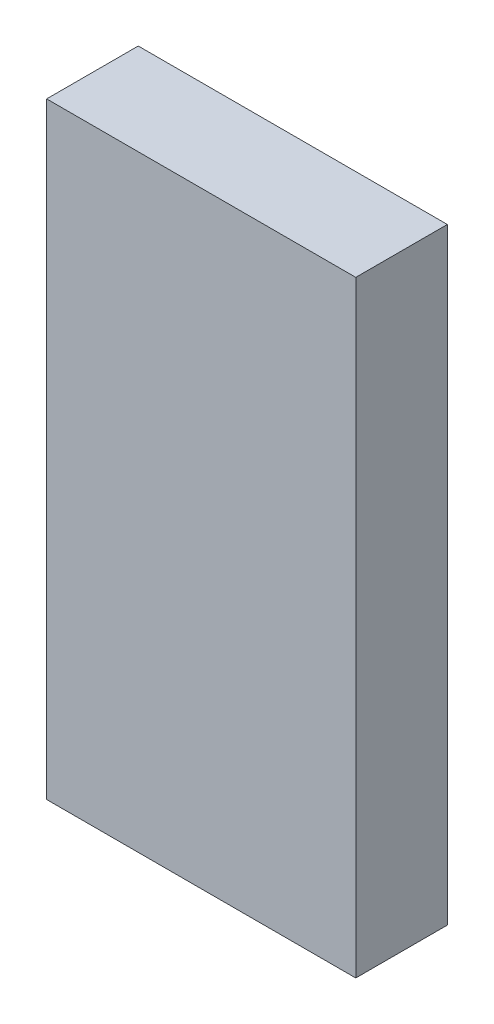
ISO-10303-21;
HEADER;
FILE_DESCRIPTION(('STEP AP214'),'2;1');
FILE_NAME('part.step','',(''),(''),'','','');
FILE_SCHEMA(('AUTOMOTIVE_DESIGN { 1 0 10303 214 1 1 1 1 }'));
ENDSEC;
DATA;
#1=APPLICATION_CONTEXT('core data for automotive mechanical design processes');
#2=APPLICATION_PROTOCOL_DEFINITION('international standard','automotive_design',2000,#1);
#3=PRODUCT_CONTEXT('',#1,'mechanical');
#4=PRODUCT('Part','Part','',(#3));
#5=PRODUCT_RELATED_PRODUCT_CATEGORY('part','',(#4));
#6=PRODUCT_DEFINITION_FORMATION('','',#4);
#7=PRODUCT_DEFINITION_CONTEXT('part definition',#1,'design');
#8=PRODUCT_DEFINITION('design','',#6,#7);
#9=PRODUCT_DEFINITION_SHAPE('','',#8);
#10=(LENGTH_UNIT() NAMED_UNIT(*) SI_UNIT(.MILLI.,.METRE.));
#11=(NAMED_UNIT(*) PLANE_ANGLE_UNIT() SI_UNIT($,.RADIAN.));
#12=(NAMED_UNIT(*) SI_UNIT($,.STERADIAN.) SOLID_ANGLE_UNIT());
#13=UNCERTAINTY_MEASURE_WITH_UNIT(LENGTH_MEASURE(1.E-05),#10,'distance_accuracy_value','');
#14=(GEOMETRIC_REPRESENTATION_CONTEXT(3) GLOBAL_UNCERTAINTY_ASSIGNED_CONTEXT((#13)) GLOBAL_UNIT_ASSIGNED_CONTEXT((#10,
#11,#12)) REPRESENTATION_CONTEXT('',''));
#15=CARTESIAN_POINT('',(0.,0.,0.));
#16=DIRECTION('',(0.,0.,1.));
#17=DIRECTION('',(1.,0.,0.));
#18=AXIS2_PLACEMENT_3D('',#15,#16,#17);
#19=CARTESIAN_POINT('',(-1.7145,3.3655,1.016));
#20=DIRECTION('',(0.,0.,1.));
#21=DIRECTION('',(1.,0.,0.));
#22=AXIS2_PLACEMENT_3D('',#19,#20,#21);
#23=PLANE('',#22);
#24=DIRECTION('',(1.,0.,0.));
#25=VECTOR('',#24,1.);
#26=CARTESIAN_POINT('',(-1.7145,3.3655,1.016));
#27=LINE('',#26,#25);
#28=CARTESIAN_POINT('',(-1.7145,3.3655,1.016));
#29=VERTEX_POINT('',#28);
#30=CARTESIAN_POINT('',(1.7145,3.3655,1.016));
#31=VERTEX_POINT('',#30);
#32=EDGE_CURVE('E85',#29,#31,#27,.T.);
#33=ORIENTED_EDGE('',*,*,#32,.F.);
#34=DIRECTION('',(0.,1.,0.));
#35=VECTOR('',#34,1.);
#36=CARTESIAN_POINT('',(-1.7145,-3.3655,1.016));
#37=LINE('',#36,#35);
#38=CARTESIAN_POINT('',(-1.7145,-3.3655,1.016));
#39=VERTEX_POINT('',#38);
#40=EDGE_CURVE('E28',#39,#29,#37,.T.);
#41=ORIENTED_EDGE('',*,*,#40,.F.);
#42=DIRECTION('',(-1.,0.,0.));
#43=VECTOR('',#42,1.);
#44=CARTESIAN_POINT('',(1.7145,-3.3655,1.016));
#45=LINE('',#44,#43);
#46=CARTESIAN_POINT('',(1.7145,-3.3655,1.016));
#47=VERTEX_POINT('',#46);
#48=EDGE_CURVE('E65',#47,#39,#45,.T.);
#49=ORIENTED_EDGE('',*,*,#48,.F.);
#50=DIRECTION('',(0.,-1.,0.));
#51=VECTOR('',#50,1.);
#52=CARTESIAN_POINT('',(1.7145,3.3655,1.016));
#53=LINE('',#52,#51);
#54=EDGE_CURVE('E21',#31,#47,#53,.T.);
#55=ORIENTED_EDGE('',*,*,#54,.F.);
#56=EDGE_LOOP('',(#33,#41,#49,#55));
#57=FACE_BOUND('',#56,.T.);
#58=ADVANCED_FACE('F17',(#57),#23,.T.);
#59=CARTESIAN_POINT('',(-1.7145,3.3655,0.));
#60=DIRECTION('',(0.,0.,1.));
#61=DIRECTION('',(1.,0.,0.));
#62=AXIS2_PLACEMENT_3D('',#59,#60,#61);
#63=PLANE('',#62);
#64=DIRECTION('',(1.,0.,0.));
#65=VECTOR('',#64,1.);
#66=CARTESIAN_POINT('',(-1.7145,3.3655,0.));
#67=LINE('',#66,#65);
#68=CARTESIAN_POINT('',(-1.7145,3.3655,0.));
#69=VERTEX_POINT('',#68);
#70=CARTESIAN_POINT('',(1.7145,3.3655,0.));
#71=VERTEX_POINT('',#70);
#72=EDGE_CURVE('E91',#69,#71,#67,.T.);
#73=ORIENTED_EDGE('',*,*,#72,.T.);
#74=DIRECTION('',(0.,-1.,0.));
#75=VECTOR('',#74,1.);
#76=CARTESIAN_POINT('',(1.7145,3.3655,0.));
#77=LINE('',#76,#75);
#78=CARTESIAN_POINT('',(1.7145,-3.3655,0.));
#79=VERTEX_POINT('',#78);
#80=EDGE_CURVE('E95',#71,#79,#77,.T.);
#81=ORIENTED_EDGE('',*,*,#80,.T.);
#82=DIRECTION('',(-1.,0.,0.));
#83=VECTOR('',#82,1.);
#84=CARTESIAN_POINT('',(1.7145,-3.3655,0.));
#85=LINE('',#84,#83);
#86=CARTESIAN_POINT('',(-1.7145,-3.3655,0.));
#87=VERTEX_POINT('',#86);
#88=EDGE_CURVE('E55',#79,#87,#85,.T.);
#89=ORIENTED_EDGE('',*,*,#88,.T.);
#90=DIRECTION('',(0.,1.,0.));
#91=VECTOR('',#90,1.);
#92=CARTESIAN_POINT('',(-1.7145,-3.3655,0.));
#93=LINE('',#92,#91);
#94=EDGE_CURVE('E11',#87,#69,#93,.T.);
#95=ORIENTED_EDGE('',*,*,#94,.T.);
#96=EDGE_LOOP('',(#73,#81,#89,#95));
#97=FACE_BOUND('',#96,.T.);
#98=ADVANCED_FACE('F161',(#97),#63,.F.);
#99=CARTESIAN_POINT('',(-1.7145,-3.3655,0.));
#100=DIRECTION('',(-1.,0.,0.));
#101=DIRECTION('',(0.,0.,1.));
#102=AXIS2_PLACEMENT_3D('',#99,#100,#101);
#103=PLANE('',#102);
#104=DIRECTION('',(0.,0.,1.));
#105=VECTOR('',#104,1.);
#106=CARTESIAN_POINT('',(-1.7145,-3.3655,0.));
#107=LINE('',#106,#105);
#108=EDGE_CURVE('E110',#87,#39,#107,.T.);
#109=ORIENTED_EDGE('',*,*,#108,.T.);
#110=ORIENTED_EDGE('',*,*,#40,.T.);
#111=DIRECTION('',(0.,0.,1.));
#112=VECTOR('',#111,1.);
#113=CARTESIAN_POINT('',(-1.7145,3.3655,0.));
#114=LINE('',#113,#112);
#115=EDGE_CURVE('E100',#69,#29,#114,.T.);
#116=ORIENTED_EDGE('',*,*,#115,.F.);
#117=ORIENTED_EDGE('',*,*,#94,.F.);
#118=EDGE_LOOP('',(#109,#110,#116,#117));
#119=FACE_BOUND('',#118,.T.);
#120=ADVANCED_FACE('F19',(#119),#103,.T.);
#121=CARTESIAN_POINT('',(1.7145,-3.3655,0.));
#122=DIRECTION('',(0.,-1.,0.));
#123=DIRECTION('',(0.,0.,-1.));
#124=AXIS2_PLACEMENT_3D('',#121,#122,#123);
#125=PLANE('',#124);
#126=DIRECTION('',(0.,0.,1.));
#127=VECTOR('',#126,1.);
#128=CARTESIAN_POINT('',(1.7145,-3.3655,0.));
#129=LINE('',#128,#127);
#130=EDGE_CURVE('E90',#79,#47,#129,.T.);
#131=ORIENTED_EDGE('',*,*,#130,.T.);
#132=ORIENTED_EDGE('',*,*,#48,.T.);
#133=ORIENTED_EDGE('',*,*,#108,.F.);
#134=ORIENTED_EDGE('',*,*,#88,.F.);
#135=EDGE_LOOP('',(#131,#132,#133,#134));
#136=FACE_BOUND('',#135,.T.);
#137=ADVANCED_FACE('F163',(#136),#125,.T.);
#138=CARTESIAN_POINT('',(1.7145,3.3655,0.));
#139=DIRECTION('',(1.,0.,0.));
#140=DIRECTION('',(0.,1.,0.));
#141=AXIS2_PLACEMENT_3D('',#138,#139,#140);
#142=PLANE('',#141);
#143=DIRECTION('',(0.,0.,1.));
#144=VECTOR('',#143,1.);
#145=CARTESIAN_POINT('',(1.7145,3.3655,0.));
#146=LINE('',#145,#144);
#147=EDGE_CURVE('E93',#71,#31,#146,.T.);
#148=ORIENTED_EDGE('',*,*,#147,.T.);
#149=ORIENTED_EDGE('',*,*,#54,.T.);
#150=ORIENTED_EDGE('',*,*,#130,.F.);
#151=ORIENTED_EDGE('',*,*,#80,.F.);
#152=EDGE_LOOP('',(#148,#149,#150,#151));
#153=FACE_BOUND('',#152,.T.);
#154=ADVANCED_FACE('F94',(#153),#142,.T.);
#155=CARTESIAN_POINT('',(-1.7145,3.3655,0.));
#156=DIRECTION('',(0.,1.,0.));
#157=DIRECTION('',(1.,0.,0.));
#158=AXIS2_PLACEMENT_3D('',#155,#156,#157);
#159=PLANE('',#158);
#160=ORIENTED_EDGE('',*,*,#115,.T.);
#161=ORIENTED_EDGE('',*,*,#32,.T.);
#162=ORIENTED_EDGE('',*,*,#147,.F.);
#163=ORIENTED_EDGE('',*,*,#72,.F.);
#164=EDGE_LOOP('',(#160,#161,#162,#163));
#165=FACE_BOUND('',#164,.T.);
#166=ADVANCED_FACE('F99',(#165),#159,.T.);
#167=CLOSED_SHELL('',(#58,#98,#120,#137,#154,#166));
#168=MANIFOLD_SOLID_BREP('B1',#167);
#169=ADVANCED_BREP_SHAPE_REPRESENTATION('',(#18,#168),#14);
#170=SHAPE_DEFINITION_REPRESENTATION(#9,#169);
ENDSEC;
END-ISO-10303-21;
